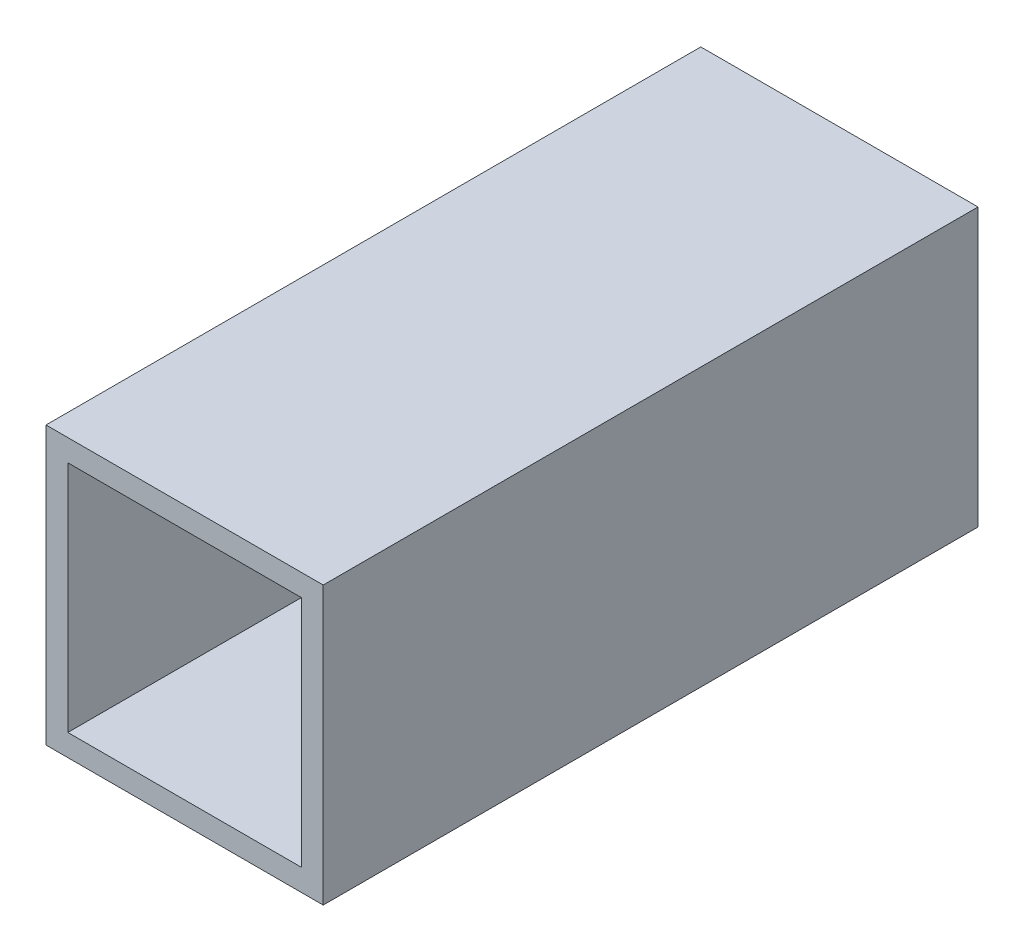
ISO-10303-21;
HEADER;
FILE_DESCRIPTION(('STEP AP214'),'2;1');
FILE_NAME('part.step','',(''),(''),'','','');
FILE_SCHEMA(('AUTOMOTIVE_DESIGN { 1 0 10303 214 1 1 1 1 }'));
ENDSEC;
DATA;
#1=APPLICATION_CONTEXT('core data for automotive mechanical design processes');
#2=APPLICATION_PROTOCOL_DEFINITION('international standard','automotive_design',2000,#1);
#3=PRODUCT_CONTEXT('',#1,'mechanical');
#4=PRODUCT('Part','Part','',(#3));
#5=PRODUCT_RELATED_PRODUCT_CATEGORY('part','',(#4));
#6=PRODUCT_DEFINITION_FORMATION('','',#4);
#7=PRODUCT_DEFINITION_CONTEXT('part definition',#1,'design');
#8=PRODUCT_DEFINITION('design','',#6,#7);
#9=PRODUCT_DEFINITION_SHAPE('','',#8);
#10=(LENGTH_UNIT() NAMED_UNIT(*) SI_UNIT(.MILLI.,.METRE.));
#11=(NAMED_UNIT(*) PLANE_ANGLE_UNIT() SI_UNIT($,.RADIAN.));
#12=(NAMED_UNIT(*) SI_UNIT($,.STERADIAN.) SOLID_ANGLE_UNIT());
#13=UNCERTAINTY_MEASURE_WITH_UNIT(LENGTH_MEASURE(1.E-05),#10,'distance_accuracy_value','');
#14=(GEOMETRIC_REPRESENTATION_CONTEXT(3) GLOBAL_UNCERTAINTY_ASSIGNED_CONTEXT((#13)) GLOBAL_UNIT_ASSIGNED_CONTEXT((#10,
#11,#12)) REPRESENTATION_CONTEXT('',''));
#15=CARTESIAN_POINT('',(0.,0.,0.));
#16=DIRECTION('',(0.,0.,1.));
#17=DIRECTION('',(1.,0.,0.));
#18=AXIS2_PLACEMENT_3D('',#15,#16,#17);
#19=CARTESIAN_POINT('',(0.,0.,60.));
#20=DIRECTION('',(0.,0.,-1.));
#21=DIRECTION('',(-1.,0.,0.));
#22=AXIS2_PLACEMENT_3D('',#19,#20,#21);
#23=PLANE('',#22);
#24=DIRECTION('',(0.,-1.,0.));
#25=VECTOR('',#24,1.);
#26=CARTESIAN_POINT('',(-12.7,12.7,60.));
#27=LINE('',#26,#25);
#28=CARTESIAN_POINT('',(-12.7,12.7,60.));
#29=VERTEX_POINT('',#28);
#30=CARTESIAN_POINT('',(-12.7,-12.7,60.));
#31=VERTEX_POINT('',#30);
#32=EDGE_CURVE('E157',#29,#31,#27,.T.);
#33=ORIENTED_EDGE('',*,*,#32,.T.);
#34=DIRECTION('',(1.,0.,0.));
#35=VECTOR('',#34,1.);
#36=CARTESIAN_POINT('',(12.7,-12.7,60.));
#37=LINE('',#36,#35);
#38=CARTESIAN_POINT('',(12.7,-12.7,60.));
#39=VERTEX_POINT('',#38);
#40=EDGE_CURVE('E161',#31,#39,#37,.T.);
#41=ORIENTED_EDGE('',*,*,#40,.T.);
#42=DIRECTION('',(0.,1.,0.));
#43=VECTOR('',#42,1.);
#44=CARTESIAN_POINT('',(12.7,12.7,60.));
#45=LINE('',#44,#43);
#46=CARTESIAN_POINT('',(12.7,12.7,60.));
#47=VERTEX_POINT('',#46);
#48=EDGE_CURVE('E165',#39,#47,#45,.T.);
#49=ORIENTED_EDGE('',*,*,#48,.T.);
#50=DIRECTION('',(-1.,0.,0.));
#51=VECTOR('',#50,1.);
#52=CARTESIAN_POINT('',(12.7,12.7,60.));
#53=LINE('',#52,#51);
#54=EDGE_CURVE('E168',#47,#29,#53,.T.);
#55=ORIENTED_EDGE('',*,*,#54,.T.);
#56=EDGE_LOOP('',(#33,#41,#49,#55));
#57=FACE_BOUND('',#56,.T.);
#58=DIRECTION('',(0.,1.,0.));
#59=VECTOR('',#58,1.);
#60=CARTESIAN_POINT('',(10.7,10.7,60.));
#61=LINE('',#60,#59);
#62=CARTESIAN_POINT('',(10.7,-10.7,60.));
#63=VERTEX_POINT('',#62);
#64=CARTESIAN_POINT('',(10.7,10.7,60.));
#65=VERTEX_POINT('',#64);
#66=EDGE_CURVE('E109',#63,#65,#61,.T.);
#67=ORIENTED_EDGE('',*,*,#66,.F.);
#68=DIRECTION('',(1.,0.,0.));
#69=VECTOR('',#68,1.);
#70=CARTESIAN_POINT('',(10.7,-10.7,60.));
#71=LINE('',#70,#69);
#72=CARTESIAN_POINT('',(-10.7,-10.7,60.));
#73=VERTEX_POINT('',#72);
#74=EDGE_CURVE('E135',#73,#63,#71,.T.);
#75=ORIENTED_EDGE('',*,*,#74,.F.);
#76=DIRECTION('',(0.,-1.,0.));
#77=VECTOR('',#76,1.);
#78=CARTESIAN_POINT('',(-10.7,10.7,60.));
#79=LINE('',#78,#77);
#80=CARTESIAN_POINT('',(-10.7,10.7,60.));
#81=VERTEX_POINT('',#80);
#82=EDGE_CURVE('E131',#81,#73,#79,.T.);
#83=ORIENTED_EDGE('',*,*,#82,.F.);
#84=DIRECTION('',(-1.,0.,0.));
#85=VECTOR('',#84,1.);
#86=CARTESIAN_POINT('',(10.7,10.7,60.));
#87=LINE('',#86,#85);
#88=EDGE_CURVE('E118',#65,#81,#87,.T.);
#89=ORIENTED_EDGE('',*,*,#88,.F.);
#90=EDGE_LOOP('',(#67,#75,#83,#89));
#91=FACE_BOUND('',#90,.T.);
#92=ADVANCED_FACE('F43',(#57,#91),#23,.F.);
#93=CARTESIAN_POINT('',(0.,0.,0.));
#94=DIRECTION('',(0.,0.,-1.));
#95=DIRECTION('',(-1.,0.,0.));
#96=AXIS2_PLACEMENT_3D('',#93,#94,#95);
#97=PLANE('',#96);
#98=DIRECTION('',(0.,-1.,0.));
#99=VECTOR('',#98,1.);
#100=CARTESIAN_POINT('',(-12.7,12.7,0.));
#101=LINE('',#100,#99);
#102=CARTESIAN_POINT('',(-12.7,12.7,0.));
#103=VERTEX_POINT('',#102);
#104=CARTESIAN_POINT('',(-12.7,-12.7,0.));
#105=VERTEX_POINT('',#104);
#106=EDGE_CURVE('E127',#103,#105,#101,.T.);
#107=ORIENTED_EDGE('',*,*,#106,.F.);
#108=DIRECTION('',(-1.,0.,0.));
#109=VECTOR('',#108,1.);
#110=CARTESIAN_POINT('',(12.7,12.7,0.));
#111=LINE('',#110,#109);
#112=CARTESIAN_POINT('',(12.7,12.7,0.));
#113=VERTEX_POINT('',#112);
#114=EDGE_CURVE('E162',#113,#103,#111,.T.);
#115=ORIENTED_EDGE('',*,*,#114,.F.);
#116=DIRECTION('',(0.,1.,0.));
#117=VECTOR('',#116,1.);
#118=CARTESIAN_POINT('',(12.7,12.7,0.));
#119=LINE('',#118,#117);
#120=CARTESIAN_POINT('',(12.7,-12.7,0.));
#121=VERTEX_POINT('',#120);
#122=EDGE_CURVE('E178',#121,#113,#119,.T.);
#123=ORIENTED_EDGE('',*,*,#122,.F.);
#124=DIRECTION('',(1.,0.,0.));
#125=VECTOR('',#124,1.);
#126=CARTESIAN_POINT('',(12.7,-12.7,0.));
#127=LINE('',#126,#125);
#128=EDGE_CURVE('E175',#105,#121,#127,.T.);
#129=ORIENTED_EDGE('',*,*,#128,.F.);
#130=EDGE_LOOP('',(#107,#115,#123,#129));
#131=FACE_BOUND('',#130,.T.);
#132=DIRECTION('',(1.,0.,0.));
#133=VECTOR('',#132,1.);
#134=CARTESIAN_POINT('',(10.7,-10.7,0.));
#135=LINE('',#134,#133);
#136=CARTESIAN_POINT('',(-10.7,-10.7,0.));
#137=VERTEX_POINT('',#136);
#138=CARTESIAN_POINT('',(10.7,-10.7,0.));
#139=VERTEX_POINT('',#138);
#140=EDGE_CURVE('E119',#137,#139,#135,.T.);
#141=ORIENTED_EDGE('',*,*,#140,.T.);
#142=DIRECTION('',(0.,1.,0.));
#143=VECTOR('',#142,1.);
#144=CARTESIAN_POINT('',(10.7,10.7,0.));
#145=LINE('',#144,#143);
#146=CARTESIAN_POINT('',(10.7,10.7,0.));
#147=VERTEX_POINT('',#146);
#148=EDGE_CURVE('E67',#139,#147,#145,.T.);
#149=ORIENTED_EDGE('',*,*,#148,.T.);
#150=DIRECTION('',(-1.,0.,0.));
#151=VECTOR('',#150,1.);
#152=CARTESIAN_POINT('',(10.7,10.7,0.));
#153=LINE('',#152,#151);
#154=CARTESIAN_POINT('',(-10.7,10.7,0.));
#155=VERTEX_POINT('',#154);
#156=EDGE_CURVE('E125',#147,#155,#153,.T.);
#157=ORIENTED_EDGE('',*,*,#156,.T.);
#158=DIRECTION('',(0.,-1.,0.));
#159=VECTOR('',#158,1.);
#160=CARTESIAN_POINT('',(-10.7,10.7,0.));
#161=LINE('',#160,#159);
#162=EDGE_CURVE('E144',#155,#137,#161,.T.);
#163=ORIENTED_EDGE('',*,*,#162,.T.);
#164=EDGE_LOOP('',(#141,#149,#157,#163));
#165=FACE_BOUND('',#164,.T.);
#166=ADVANCED_FACE('F201',(#131,#165),#97,.T.);
#167=CARTESIAN_POINT('',(-12.7,12.7,60.));
#168=DIRECTION('',(1.,0.,0.));
#169=DIRECTION('',(0.,1.,0.));
#170=AXIS2_PLACEMENT_3D('',#167,#168,#169);
#171=PLANE('',#170);
#172=ORIENTED_EDGE('',*,*,#106,.T.);
#173=DIRECTION('',(0.,0.,-1.));
#174=VECTOR('',#173,1.);
#175=CARTESIAN_POINT('',(-12.7,-12.7,60.));
#176=LINE('',#175,#174);
#177=EDGE_CURVE('E11',#31,#105,#176,.T.);
#178=ORIENTED_EDGE('',*,*,#177,.F.);
#179=ORIENTED_EDGE('',*,*,#32,.F.);
#180=DIRECTION('',(0.,0.,-1.));
#181=VECTOR('',#180,1.);
#182=CARTESIAN_POINT('',(-12.7,12.7,60.));
#183=LINE('',#182,#181);
#184=EDGE_CURVE('E171',#29,#103,#183,.T.);
#185=ORIENTED_EDGE('',*,*,#184,.T.);
#186=EDGE_LOOP('',(#172,#178,#179,#185));
#187=FACE_BOUND('',#186,.T.);
#188=ADVANCED_FACE('F45',(#187),#171,.F.);
#189=CARTESIAN_POINT('',(12.7,-12.7,60.));
#190=DIRECTION('',(0.,1.,0.));
#191=DIRECTION('',(-1.,0.,0.));
#192=AXIS2_PLACEMENT_3D('',#189,#190,#191);
#193=PLANE('',#192);
#194=ORIENTED_EDGE('',*,*,#128,.T.);
#195=DIRECTION('',(0.,0.,-1.));
#196=VECTOR('',#195,1.);
#197=CARTESIAN_POINT('',(12.7,-12.7,60.));
#198=LINE('',#197,#196);
#199=EDGE_CURVE('E52',#39,#121,#198,.T.);
#200=ORIENTED_EDGE('',*,*,#199,.F.);
#201=ORIENTED_EDGE('',*,*,#40,.F.);
#202=ORIENTED_EDGE('',*,*,#177,.T.);
#203=EDGE_LOOP('',(#194,#200,#201,#202));
#204=FACE_BOUND('',#203,.T.);
#205=ADVANCED_FACE('F211',(#204),#193,.F.);
#206=CARTESIAN_POINT('',(12.7,12.7,60.));
#207=DIRECTION('',(-1.,0.,0.));
#208=DIRECTION('',(0.,-1.,0.));
#209=AXIS2_PLACEMENT_3D('',#206,#207,#208);
#210=PLANE('',#209);
#211=ORIENTED_EDGE('',*,*,#122,.T.);
#212=DIRECTION('',(0.,0.,-1.));
#213=VECTOR('',#212,1.);
#214=CARTESIAN_POINT('',(12.7,12.7,60.));
#215=LINE('',#214,#213);
#216=EDGE_CURVE('E186',#47,#113,#215,.T.);
#217=ORIENTED_EDGE('',*,*,#216,.F.);
#218=ORIENTED_EDGE('',*,*,#48,.F.);
#219=ORIENTED_EDGE('',*,*,#199,.T.);
#220=EDGE_LOOP('',(#211,#217,#218,#219));
#221=FACE_BOUND('',#220,.T.);
#222=ADVANCED_FACE('F195',(#221),#210,.F.);
#223=CARTESIAN_POINT('',(12.7,12.7,60.));
#224=DIRECTION('',(0.,-1.,0.));
#225=DIRECTION('',(1.,0.,0.));
#226=AXIS2_PLACEMENT_3D('',#223,#224,#225);
#227=PLANE('',#226);
#228=ORIENTED_EDGE('',*,*,#114,.T.);
#229=ORIENTED_EDGE('',*,*,#184,.F.);
#230=ORIENTED_EDGE('',*,*,#54,.F.);
#231=ORIENTED_EDGE('',*,*,#216,.T.);
#232=EDGE_LOOP('',(#228,#229,#230,#231));
#233=FACE_BOUND('',#232,.T.);
#234=ADVANCED_FACE('F205',(#233),#227,.F.);
#235=CARTESIAN_POINT('',(10.7,10.7,60.));
#236=DIRECTION('',(-1.,0.,0.));
#237=DIRECTION('',(0.,-1.,0.));
#238=AXIS2_PLACEMENT_3D('',#235,#236,#237);
#239=PLANE('',#238);
#240=ORIENTED_EDGE('',*,*,#148,.F.);
#241=DIRECTION('',(0.,0.,-1.));
#242=VECTOR('',#241,1.);
#243=CARTESIAN_POINT('',(10.7,-10.7,60.));
#244=LINE('',#243,#242);
#245=EDGE_CURVE('E113',#63,#139,#244,.T.);
#246=ORIENTED_EDGE('',*,*,#245,.F.);
#247=ORIENTED_EDGE('',*,*,#66,.T.);
#248=DIRECTION('',(0.,0.,-1.));
#249=VECTOR('',#248,1.);
#250=CARTESIAN_POINT('',(10.7,10.7,60.));
#251=LINE('',#250,#249);
#252=EDGE_CURVE('E112',#65,#147,#251,.T.);
#253=ORIENTED_EDGE('',*,*,#252,.T.);
#254=EDGE_LOOP('',(#240,#246,#247,#253));
#255=FACE_BOUND('',#254,.T.);
#256=ADVANCED_FACE('F111',(#255),#239,.T.);
#257=CARTESIAN_POINT('',(10.7,10.7,60.));
#258=DIRECTION('',(0.,-1.,0.));
#259=DIRECTION('',(1.,0.,0.));
#260=AXIS2_PLACEMENT_3D('',#257,#258,#259);
#261=PLANE('',#260);
#262=ORIENTED_EDGE('',*,*,#156,.F.);
#263=ORIENTED_EDGE('',*,*,#252,.F.);
#264=ORIENTED_EDGE('',*,*,#88,.T.);
#265=DIRECTION('',(0.,0.,-1.));
#266=VECTOR('',#265,1.);
#267=CARTESIAN_POINT('',(-10.7,10.7,60.));
#268=LINE('',#267,#266);
#269=EDGE_CURVE('E128',#81,#155,#268,.T.);
#270=ORIENTED_EDGE('',*,*,#269,.T.);
#271=EDGE_LOOP('',(#262,#263,#264,#270));
#272=FACE_BOUND('',#271,.T.);
#273=ADVANCED_FACE('F122',(#272),#261,.T.);
#274=CARTESIAN_POINT('',(-10.7,10.7,60.));
#275=DIRECTION('',(1.,0.,0.));
#276=DIRECTION('',(0.,1.,0.));
#277=AXIS2_PLACEMENT_3D('',#274,#275,#276);
#278=PLANE('',#277);
#279=ORIENTED_EDGE('',*,*,#162,.F.);
#280=ORIENTED_EDGE('',*,*,#269,.F.);
#281=ORIENTED_EDGE('',*,*,#82,.T.);
#282=DIRECTION('',(0.,0.,-1.));
#283=VECTOR('',#282,1.);
#284=CARTESIAN_POINT('',(-10.7,-10.7,60.));
#285=LINE('',#284,#283);
#286=EDGE_CURVE('E59',#73,#137,#285,.T.);
#287=ORIENTED_EDGE('',*,*,#286,.T.);
#288=EDGE_LOOP('',(#279,#280,#281,#287));
#289=FACE_BOUND('',#288,.T.);
#290=ADVANCED_FACE('F234',(#289),#278,.T.);
#291=CARTESIAN_POINT('',(10.7,-10.7,60.));
#292=DIRECTION('',(0.,1.,0.));
#293=DIRECTION('',(-1.,0.,0.));
#294=AXIS2_PLACEMENT_3D('',#291,#292,#293);
#295=PLANE('',#294);
#296=ORIENTED_EDGE('',*,*,#140,.F.);
#297=ORIENTED_EDGE('',*,*,#286,.F.);
#298=ORIENTED_EDGE('',*,*,#74,.T.);
#299=ORIENTED_EDGE('',*,*,#245,.T.);
#300=EDGE_LOOP('',(#296,#297,#298,#299));
#301=FACE_BOUND('',#300,.T.);
#302=ADVANCED_FACE('F238',(#301),#295,.T.);
#303=CLOSED_SHELL('',(#92,#166,#188,#205,#222,#234,#256,#273,#290,#302));
#304=MANIFOLD_SOLID_BREP('B2',#303);
#305=ADVANCED_BREP_SHAPE_REPRESENTATION('',(#18,#304),#14);
#306=SHAPE_DEFINITION_REPRESENTATION(#9,#305);
ENDSEC;
END-ISO-10303-21;
